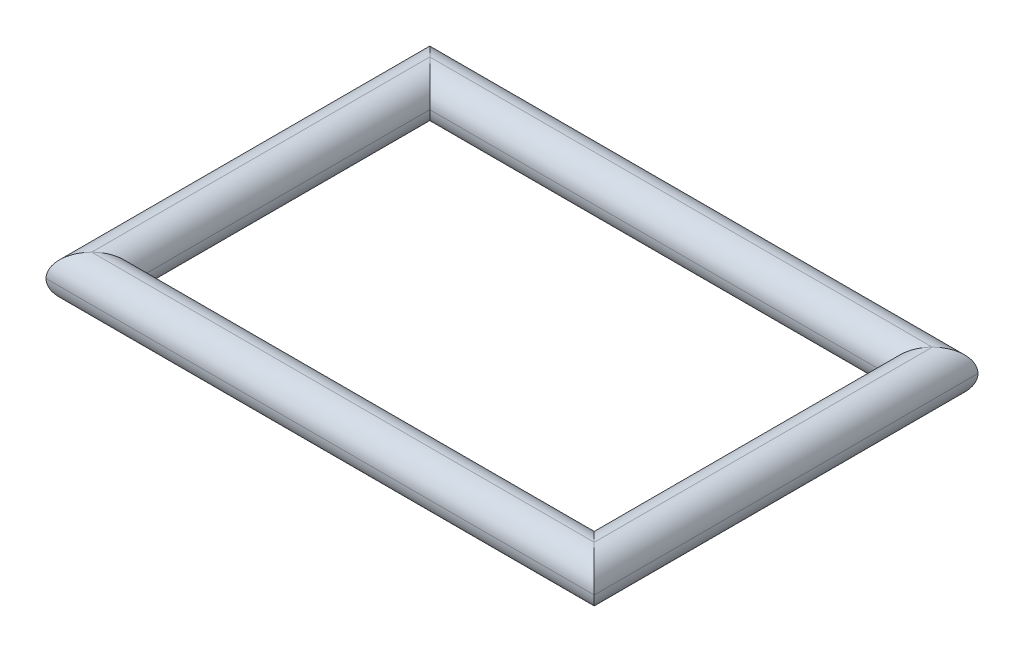
ISO-10303-21;
HEADER;
FILE_DESCRIPTION(('STEP AP214'),'2;1');
FILE_NAME('part.step','',(''),(''),'','','');
FILE_SCHEMA(('AUTOMOTIVE_DESIGN { 1 0 10303 214 1 1 1 1 }'));
ENDSEC;
DATA;
#1=APPLICATION_CONTEXT('core data for automotive mechanical design processes');
#2=APPLICATION_PROTOCOL_DEFINITION('international standard','automotive_design',2000,#1);
#3=PRODUCT_CONTEXT('',#1,'mechanical');
#4=PRODUCT('Part','Part','',(#3));
#5=PRODUCT_RELATED_PRODUCT_CATEGORY('part','',(#4));
#6=PRODUCT_DEFINITION_FORMATION('','',#4);
#7=PRODUCT_DEFINITION_CONTEXT('part definition',#1,'design');
#8=PRODUCT_DEFINITION('design','',#6,#7);
#9=PRODUCT_DEFINITION_SHAPE('','',#8);
#10=(LENGTH_UNIT() NAMED_UNIT(*) SI_UNIT(.MILLI.,.METRE.));
#11=(NAMED_UNIT(*) PLANE_ANGLE_UNIT() SI_UNIT($,.RADIAN.));
#12=(NAMED_UNIT(*) SI_UNIT($,.STERADIAN.) SOLID_ANGLE_UNIT());
#13=UNCERTAINTY_MEASURE_WITH_UNIT(LENGTH_MEASURE(1.E-05),#10,'distance_accuracy_value','');
#14=(GEOMETRIC_REPRESENTATION_CONTEXT(3) GLOBAL_UNCERTAINTY_ASSIGNED_CONTEXT((#13)) GLOBAL_UNIT_ASSIGNED_CONTEXT((#10,
#11,#12)) REPRESENTATION_CONTEXT('',''));
#15=CARTESIAN_POINT('',(0.,0.,0.));
#16=DIRECTION('',(0.,0.,1.));
#17=DIRECTION('',(1.,0.,0.));
#18=AXIS2_PLACEMENT_3D('',#15,#16,#17);
#19=CARTESIAN_POINT('',(-30.5188679245283,2.5,-20.4716981132076));
#20=DIRECTION('',(0.,0.,1.));
#21=DIRECTION('',(1.,0.,0.));
#22=AXIS2_PLACEMENT_3D('',#19,#20,#21);
#23=CYLINDRICAL_SURFACE('',#22,2.5);
#24=CARTESIAN_POINT('',(-30.5188679245283,2.5,14.0283018867924));
#25=DIRECTION('',(0.707106781186547,0.,0.707106781186547));
#26=DIRECTION('',(-0.707106781186547,0.,0.707106781186548));
#27=AXIS2_PLACEMENT_3D('',#24,#25,#26);
#28=ELLIPSE('',#27,3.53553390593274,2.5);
#29=CARTESIAN_POINT('',(-28.0188679245283,2.5,11.5283018867924));
#30=VERTEX_POINT('',#29);
#31=CARTESIAN_POINT('',(-30.5188679245283,5.,14.0283018867924));
#32=VERTEX_POINT('',#31);
#33=EDGE_CURVE('E54',#30,#32,#28,.T.);
#34=ORIENTED_EDGE('',*,*,#33,.F.);
#35=DIRECTION('',(0.,0.,1.));
#36=VECTOR('',#35,1.);
#37=CARTESIAN_POINT('',(-28.0188679245283,2.5,-20.4716981132076));
#38=LINE('',#37,#36);
#39=CARTESIAN_POINT('',(-28.0188679245283,2.5,-20.4716981132076));
#40=VERTEX_POINT('',#39);
#41=EDGE_CURVE('E45',#40,#30,#38,.T.);
#42=ORIENTED_EDGE('',*,*,#41,.F.);
#43=CARTESIAN_POINT('',(-30.5188679245283,2.5,-22.9716981132076));
#44=DIRECTION('',(-0.707106781186547,0.,0.707106781186548));
#45=DIRECTION('',(-0.707106781186547,0.,-0.707106781186547));
#46=AXIS2_PLACEMENT_3D('',#43,#44,#45);
#47=ELLIPSE('',#46,3.53553390593274,2.5);
#48=CARTESIAN_POINT('',(-30.5188679245283,5.,-22.9716981132076));
#49=VERTEX_POINT('',#48);
#50=EDGE_CURVE('E167',#49,#40,#47,.F.);
#51=ORIENTED_EDGE('',*,*,#50,.F.);
#52=DIRECTION('',(0.,0.,1.));
#53=VECTOR('',#52,1.);
#54=CARTESIAN_POINT('',(-30.5188679245283,5.,0.));
#55=LINE('',#54,#53);
#56=EDGE_CURVE('E173',#32,#49,#55,.F.);
#57=ORIENTED_EDGE('',*,*,#56,.F.);
#58=EDGE_LOOP('',(#34,#42,#51,#57));
#59=FACE_BOUND('',#58,.T.);
#60=ADVANCED_FACE('F35',(#59),#23,.T.);
#61=CARTESIAN_POINT('',(-28.0188679245283,2.5,-22.9716981132076));
#62=DIRECTION('',(-1.,0.,0.));
#63=DIRECTION('',(0.,0.,1.));
#64=AXIS2_PLACEMENT_3D('',#61,#62,#63);
#65=CYLINDRICAL_SURFACE('',#64,2.5);
#66=ORIENTED_EDGE('',*,*,#50,.T.);
#67=DIRECTION('',(-1.,0.,0.));
#68=VECTOR('',#67,1.);
#69=CARTESIAN_POINT('',(-28.0188679245283,2.5,-20.4716981132076));
#70=LINE('',#69,#68);
#71=CARTESIAN_POINT('',(21.9811320754717,2.5,-20.4716981132076));
#72=VERTEX_POINT('',#71);
#73=EDGE_CURVE('E180',#72,#40,#70,.T.);
#74=ORIENTED_EDGE('',*,*,#73,.F.);
#75=CARTESIAN_POINT('',(24.4811320754717,2.5,-22.9716981132076));
#76=DIRECTION('',(-0.707106781186548,0.,-0.707106781186547));
#77=DIRECTION('',(0.707106781186547,0.,-0.707106781186548));
#78=AXIS2_PLACEMENT_3D('',#75,#76,#77);
#79=ELLIPSE('',#78,3.53553390593274,2.5);
#80=CARTESIAN_POINT('',(24.4811320754717,5.,-22.9716981132076));
#81=VERTEX_POINT('',#80);
#82=EDGE_CURVE('E195',#81,#72,#79,.F.);
#83=ORIENTED_EDGE('',*,*,#82,.F.);
#84=DIRECTION('',(-1.,0.,0.));
#85=VECTOR('',#84,1.);
#86=CARTESIAN_POINT('',(0.,5.,-22.9716981132076));
#87=LINE('',#86,#85);
#88=EDGE_CURVE('E156',#49,#81,#87,.F.);
#89=ORIENTED_EDGE('',*,*,#88,.F.);
#90=EDGE_LOOP('',(#66,#74,#83,#89));
#91=FACE_BOUND('',#90,.T.);
#92=ADVANCED_FACE('F217',(#91),#65,.T.);
#93=CARTESIAN_POINT('',(-30.5188679245283,2.5,0.));
#94=DIRECTION('',(0.,0.,1.));
#95=DIRECTION('',(1.,0.,0.));
#96=AXIS2_PLACEMENT_3D('',#93,#94,#95);
#97=CYLINDRICAL_SURFACE('',#96,2.5);
#98=CARTESIAN_POINT('',(-30.5188679245283,2.5,14.0283018867924));
#99=DIRECTION('',(0.707106781186548,0.,0.707106781186547));
#100=DIRECTION('',(-0.707106781186547,0.,0.707106781186548));
#101=AXIS2_PLACEMENT_3D('',#98,#99,#100);
#102=ELLIPSE('',#101,3.53553390593274,2.5);
#103=CARTESIAN_POINT('',(-33.0188679245283,2.5,16.5283018867924));
#104=VERTEX_POINT('',#103);
#105=EDGE_CURVE('E189',#32,#104,#102,.T.);
#106=ORIENTED_EDGE('',*,*,#105,.F.);
#107=ORIENTED_EDGE('',*,*,#56,.T.);
#108=CARTESIAN_POINT('',(-30.5188679245283,2.5,-22.9716981132076));
#109=DIRECTION('',(-0.707106781186547,0.,0.707106781186548));
#110=DIRECTION('',(-0.707106781186548,0.,-0.707106781186547));
#111=AXIS2_PLACEMENT_3D('',#108,#109,#110);
#112=ELLIPSE('',#111,3.53553390593274,2.5);
#113=CARTESIAN_POINT('',(-33.0188679245283,2.5,-25.4716981132076));
#114=VERTEX_POINT('',#113);
#115=EDGE_CURVE('E192',#114,#49,#112,.F.);
#116=ORIENTED_EDGE('',*,*,#115,.F.);
#117=DIRECTION('',(0.,0.,1.));
#118=VECTOR('',#117,1.);
#119=CARTESIAN_POINT('',(-33.0188679245283,2.5,-25.4716981132076));
#120=LINE('',#119,#118);
#121=EDGE_CURVE('E170',#104,#114,#120,.F.);
#122=ORIENTED_EDGE('',*,*,#121,.F.);
#123=EDGE_LOOP('',(#106,#107,#116,#122));
#124=FACE_BOUND('',#123,.T.);
#125=ADVANCED_FACE('F220',(#124),#97,.T.);
#126=CARTESIAN_POINT('',(-28.0188679245283,2.5,14.0283018867924));
#127=DIRECTION('',(1.,0.,0.));
#128=DIRECTION('',(0.,0.,-1.));
#129=AXIS2_PLACEMENT_3D('',#126,#127,#128);
#130=CYLINDRICAL_SURFACE('',#129,2.5);
#131=CARTESIAN_POINT('',(24.4811320754717,2.5,14.0283018867924));
#132=DIRECTION('',(0.707106781186547,0.,-0.707106781186548));
#133=DIRECTION('',(-0.707106781186548,0.,-0.707106781186547));
#134=AXIS2_PLACEMENT_3D('',#131,#132,#133);
#135=ELLIPSE('',#134,3.53553390593274,2.5);
#136=CARTESIAN_POINT('',(21.9811320754717,2.5,11.5283018867924));
#137=VERTEX_POINT('',#136);
#138=CARTESIAN_POINT('',(24.4811320754717,5.,14.0283018867924));
#139=VERTEX_POINT('',#138);
#140=EDGE_CURVE('E135',#137,#139,#135,.T.);
#141=ORIENTED_EDGE('',*,*,#140,.F.);
#142=DIRECTION('',(1.,0.,0.));
#143=VECTOR('',#142,1.);
#144=CARTESIAN_POINT('',(-28.0188679245283,2.5,11.5283018867924));
#145=LINE('',#144,#143);
#146=EDGE_CURVE('E12',#30,#137,#145,.T.);
#147=ORIENTED_EDGE('',*,*,#146,.F.);
#148=ORIENTED_EDGE('',*,*,#33,.T.);
#149=DIRECTION('',(1.,0.,0.));
#150=VECTOR('',#149,1.);
#151=CARTESIAN_POINT('',(0.,5.,14.0283018867924));
#152=LINE('',#151,#150);
#153=EDGE_CURVE('E186',#139,#32,#152,.F.);
#154=ORIENTED_EDGE('',*,*,#153,.F.);
#155=EDGE_LOOP('',(#141,#147,#148,#154));
#156=FACE_BOUND('',#155,.T.);
#157=ADVANCED_FACE('F221',(#156),#130,.T.);
#158=CARTESIAN_POINT('',(24.4811320754717,2.5,-20.4716981132076));
#159=DIRECTION('',(0.,0.,-1.));
#160=DIRECTION('',(-1.,0.,0.));
#161=AXIS2_PLACEMENT_3D('',#158,#159,#160);
#162=CYLINDRICAL_SURFACE('',#161,2.5);
#163=DIRECTION('',(0.,0.,-1.));
#164=VECTOR('',#163,1.);
#165=CARTESIAN_POINT('',(21.9811320754717,2.5,-20.4716981132076));
#166=LINE('',#165,#164);
#167=EDGE_CURVE('E89',#137,#72,#166,.T.);
#168=ORIENTED_EDGE('',*,*,#167,.F.);
#169=ORIENTED_EDGE('',*,*,#140,.T.);
#170=DIRECTION('',(0.,0.,-1.));
#171=VECTOR('',#170,1.);
#172=CARTESIAN_POINT('',(24.4811320754717,5.,0.));
#173=LINE('',#172,#171);
#174=EDGE_CURVE('E160',#81,#139,#173,.F.);
#175=ORIENTED_EDGE('',*,*,#174,.F.);
#176=ORIENTED_EDGE('',*,*,#82,.T.);
#177=EDGE_LOOP('',(#168,#169,#175,#176));
#178=FACE_BOUND('',#177,.T.);
#179=ADVANCED_FACE('F232',(#178),#162,.T.);
#180=CARTESIAN_POINT('',(-33.0188679245283,2.5,-22.9716981132076));
#181=DIRECTION('',(-1.,0.,0.));
#182=DIRECTION('',(0.,0.,1.));
#183=AXIS2_PLACEMENT_3D('',#180,#181,#182);
#184=CYLINDRICAL_SURFACE('',#183,2.5);
#185=ORIENTED_EDGE('',*,*,#115,.T.);
#186=ORIENTED_EDGE('',*,*,#88,.T.);
#187=CARTESIAN_POINT('',(24.4811320754717,2.5,-22.9716981132076));
#188=DIRECTION('',(-0.707106781186548,0.,-0.707106781186547));
#189=DIRECTION('',(-0.707106781186547,0.,0.707106781186548));
#190=AXIS2_PLACEMENT_3D('',#187,#188,#189);
#191=ELLIPSE('',#190,3.53553390593274,2.5);
#192=CARTESIAN_POINT('',(26.9811320754717,2.5,-25.4716981132076));
#193=VERTEX_POINT('',#192);
#194=EDGE_CURVE('E151',#193,#81,#191,.F.);
#195=ORIENTED_EDGE('',*,*,#194,.F.);
#196=DIRECTION('',(1.,0.,0.));
#197=VECTOR('',#196,1.);
#198=CARTESIAN_POINT('',(26.9811320754717,2.5,-25.4716981132076));
#199=LINE('',#198,#197);
#200=EDGE_CURVE('E118',#114,#193,#199,.T.);
#201=ORIENTED_EDGE('',*,*,#200,.F.);
#202=EDGE_LOOP('',(#185,#186,#195,#201));
#203=FACE_BOUND('',#202,.T.);
#204=ADVANCED_FACE('F154',(#203),#184,.T.);
#205=CARTESIAN_POINT('',(0.,2.5,14.0283018867924));
#206=DIRECTION('',(1.,0.,0.));
#207=DIRECTION('',(0.,0.,-1.));
#208=AXIS2_PLACEMENT_3D('',#205,#206,#207);
#209=CYLINDRICAL_SURFACE('',#208,2.5);
#210=ORIENTED_EDGE('',*,*,#105,.T.);
#211=DIRECTION('',(1.,0.,0.));
#212=VECTOR('',#211,1.);
#213=CARTESIAN_POINT('',(-33.0188679245283,2.5,16.5283018867924));
#214=LINE('',#213,#212);
#215=CARTESIAN_POINT('',(26.9811320754717,2.5,16.5283018867924));
#216=VERTEX_POINT('',#215);
#217=EDGE_CURVE('E166',#216,#104,#214,.F.);
#218=ORIENTED_EDGE('',*,*,#217,.F.);
#219=CARTESIAN_POINT('',(24.4811320754717,2.5,14.0283018867924));
#220=DIRECTION('',(0.707106781186547,0.,-0.707106781186548));
#221=DIRECTION('',(0.707106781186548,0.,0.707106781186547));
#222=AXIS2_PLACEMENT_3D('',#219,#220,#221);
#223=ELLIPSE('',#222,3.53553390593274,2.5);
#224=EDGE_CURVE('E94',#139,#216,#223,.T.);
#225=ORIENTED_EDGE('',*,*,#224,.F.);
#226=ORIENTED_EDGE('',*,*,#153,.T.);
#227=EDGE_LOOP('',(#210,#218,#225,#226));
#228=FACE_BOUND('',#227,.T.);
#229=ADVANCED_FACE('F224',(#228),#209,.T.);
#230=CARTESIAN_POINT('',(24.4811320754717,2.5,-25.4716981132076));
#231=DIRECTION('',(0.,0.,-1.));
#232=DIRECTION('',(-1.,0.,0.));
#233=AXIS2_PLACEMENT_3D('',#230,#231,#232);
#234=CYLINDRICAL_SURFACE('',#233,2.5);
#235=ORIENTED_EDGE('',*,*,#194,.T.);
#236=ORIENTED_EDGE('',*,*,#174,.T.);
#237=ORIENTED_EDGE('',*,*,#224,.T.);
#238=DIRECTION('',(0.,0.,1.));
#239=VECTOR('',#238,1.);
#240=CARTESIAN_POINT('',(26.9811320754717,2.5,16.5283018867924));
#241=LINE('',#240,#239);
#242=EDGE_CURVE('E162',#193,#216,#241,.T.);
#243=ORIENTED_EDGE('',*,*,#242,.F.);
#244=EDGE_LOOP('',(#235,#236,#237,#243));
#245=FACE_BOUND('',#244,.T.);
#246=ADVANCED_FACE('F163',(#245),#234,.T.);
#247=CARTESIAN_POINT('',(24.4811320754717,2.5,0.));
#248=DIRECTION('',(0.,0.,1.));
#249=DIRECTION('',(1.,0.,0.));
#250=AXIS2_PLACEMENT_3D('',#247,#248,#249);
#251=CYLINDRICAL_SURFACE('',#250,2.5);
#252=CARTESIAN_POINT('',(24.4811320754717,2.5,14.0283018867924));
#253=DIRECTION('',(-0.707106781186547,0.,0.707106781186548));
#254=DIRECTION('',(0.707106781186548,0.,0.707106781186547));
#255=AXIS2_PLACEMENT_3D('',#252,#253,#254);
#256=ELLIPSE('',#255,3.53553390593274,2.5);
#257=CARTESIAN_POINT('',(24.4811320754717,0.,14.0283018867924));
#258=VERTEX_POINT('',#257);
#259=EDGE_CURVE('E106',#137,#258,#256,.T.);
#260=ORIENTED_EDGE('',*,*,#259,.F.);
#261=ORIENTED_EDGE('',*,*,#167,.T.);
#262=CARTESIAN_POINT('',(24.4811320754717,2.5,-22.9716981132076));
#263=DIRECTION('',(0.707106781186548,0.,0.707106781186547));
#264=DIRECTION('',(0.707106781186547,0.,-0.707106781186548));
#265=AXIS2_PLACEMENT_3D('',#262,#263,#264);
#266=ELLIPSE('',#265,3.53553390593274,2.5);
#267=CARTESIAN_POINT('',(24.4811320754717,0.,-22.9716981132076));
#268=VERTEX_POINT('',#267);
#269=EDGE_CURVE('E39',#268,#72,#266,.F.);
#270=ORIENTED_EDGE('',*,*,#269,.F.);
#271=DIRECTION('',(0.,0.,-1.));
#272=VECTOR('',#271,1.);
#273=CARTESIAN_POINT('',(24.4811320754717,0.,-20.4716981132076));
#274=LINE('',#273,#272);
#275=EDGE_CURVE('E83',#258,#268,#274,.T.);
#276=ORIENTED_EDGE('',*,*,#275,.F.);
#277=EDGE_LOOP('',(#260,#261,#270,#276));
#278=FACE_BOUND('',#277,.T.);
#279=ADVANCED_FACE('F37',(#278),#251,.T.);
#280=CARTESIAN_POINT('',(0.,2.5,-22.9716981132076));
#281=DIRECTION('',(1.,0.,0.));
#282=DIRECTION('',(0.,0.,-1.));
#283=AXIS2_PLACEMENT_3D('',#280,#281,#282);
#284=CYLINDRICAL_SURFACE('',#283,2.5);
#285=ORIENTED_EDGE('',*,*,#269,.T.);
#286=ORIENTED_EDGE('',*,*,#73,.T.);
#287=CARTESIAN_POINT('',(-30.5188679245283,2.5,-22.9716981132076));
#288=DIRECTION('',(0.707106781186547,0.,-0.707106781186548));
#289=DIRECTION('',(0.707106781186547,0.,0.707106781186547));
#290=AXIS2_PLACEMENT_3D('',#287,#288,#289);
#291=ELLIPSE('',#290,3.53553390593274,2.5);
#292=CARTESIAN_POINT('',(-30.5188679245283,0.,-22.9716981132076));
#293=VERTEX_POINT('',#292);
#294=EDGE_CURVE('E111',#293,#40,#291,.F.);
#295=ORIENTED_EDGE('',*,*,#294,.F.);
#296=DIRECTION('',(-1.,0.,0.));
#297=VECTOR('',#296,1.);
#298=CARTESIAN_POINT('',(-28.0188679245283,0.,-22.9716981132076));
#299=LINE('',#298,#297);
#300=EDGE_CURVE('E108',#268,#293,#299,.T.);
#301=ORIENTED_EDGE('',*,*,#300,.F.);
#302=EDGE_LOOP('',(#285,#286,#295,#301));
#303=FACE_BOUND('',#302,.T.);
#304=ADVANCED_FACE('F109',(#303),#284,.T.);
#305=CARTESIAN_POINT('',(24.4811320754717,2.5,0.));
#306=DIRECTION('',(0.,0.,1.));
#307=DIRECTION('',(1.,0.,0.));
#308=AXIS2_PLACEMENT_3D('',#305,#306,#307);
#309=CYLINDRICAL_SURFACE('',#308,2.5);
#310=CARTESIAN_POINT('',(24.4811320754717,2.5,14.0283018867924));
#311=DIRECTION('',(-0.707106781186547,0.,0.707106781186548));
#312=DIRECTION('',(0.707106781186548,0.,0.707106781186547));
#313=AXIS2_PLACEMENT_3D('',#310,#311,#312);
#314=ELLIPSE('',#313,3.53553390593274,2.5);
#315=EDGE_CURVE('E104',#258,#216,#314,.T.);
#316=ORIENTED_EDGE('',*,*,#315,.F.);
#317=ORIENTED_EDGE('',*,*,#275,.T.);
#318=CARTESIAN_POINT('',(24.4811320754717,2.5,-22.9716981132076));
#319=DIRECTION('',(0.707106781186548,0.,0.707106781186547));
#320=DIRECTION('',(0.707106781186547,0.,-0.707106781186548));
#321=AXIS2_PLACEMENT_3D('',#318,#319,#320);
#322=ELLIPSE('',#321,3.53553390593274,2.5);
#323=EDGE_CURVE('E101',#193,#268,#322,.F.);
#324=ORIENTED_EDGE('',*,*,#323,.F.);
#325=ORIENTED_EDGE('',*,*,#242,.T.);
#326=EDGE_LOOP('',(#316,#317,#324,#325));
#327=FACE_BOUND('',#326,.T.);
#328=ADVANCED_FACE('F98',(#327),#309,.T.);
#329=CARTESIAN_POINT('',(0.,2.5,14.0283018867924));
#330=DIRECTION('',(-1.,0.,0.));
#331=DIRECTION('',(0.,0.,1.));
#332=AXIS2_PLACEMENT_3D('',#329,#330,#331);
#333=CYLINDRICAL_SURFACE('',#332,2.5);
#334=CARTESIAN_POINT('',(-30.5188679245283,2.5,14.0283018867924));
#335=DIRECTION('',(-0.707106781186547,0.,-0.707106781186547));
#336=DIRECTION('',(-0.707106781186547,0.,0.707106781186548));
#337=AXIS2_PLACEMENT_3D('',#334,#335,#336);
#338=ELLIPSE('',#337,3.53553390593274,2.5);
#339=CARTESIAN_POINT('',(-30.5188679245283,0.,14.0283018867924));
#340=VERTEX_POINT('',#339);
#341=EDGE_CURVE('E125',#30,#340,#338,.T.);
#342=ORIENTED_EDGE('',*,*,#341,.F.);
#343=ORIENTED_EDGE('',*,*,#146,.T.);
#344=ORIENTED_EDGE('',*,*,#259,.T.);
#345=DIRECTION('',(1.,0.,0.));
#346=VECTOR('',#345,1.);
#347=CARTESIAN_POINT('',(21.9811320754717,0.,14.0283018867924));
#348=LINE('',#347,#346);
#349=EDGE_CURVE('E120',#340,#258,#348,.T.);
#350=ORIENTED_EDGE('',*,*,#349,.F.);
#351=EDGE_LOOP('',(#342,#343,#344,#350));
#352=FACE_BOUND('',#351,.T.);
#353=ADVANCED_FACE('F130',(#352),#333,.T.);
#354=CARTESIAN_POINT('',(-30.5188679245283,2.5,0.));
#355=DIRECTION('',(0.,0.,-1.));
#356=DIRECTION('',(-1.,0.,0.));
#357=AXIS2_PLACEMENT_3D('',#354,#355,#356);
#358=CYLINDRICAL_SURFACE('',#357,2.5);
#359=ORIENTED_EDGE('',*,*,#41,.T.);
#360=ORIENTED_EDGE('',*,*,#341,.T.);
#361=DIRECTION('',(0.,0.,1.));
#362=VECTOR('',#361,1.);
#363=CARTESIAN_POINT('',(-30.5188679245283,0.,11.5283018867924));
#364=LINE('',#363,#362);
#365=EDGE_CURVE('E206',#293,#340,#364,.T.);
#366=ORIENTED_EDGE('',*,*,#365,.F.);
#367=ORIENTED_EDGE('',*,*,#294,.T.);
#368=EDGE_LOOP('',(#359,#360,#366,#367));
#369=FACE_BOUND('',#368,.T.);
#370=ADVANCED_FACE('F214',(#369),#358,.T.);
#371=CARTESIAN_POINT('',(0.,2.5,-22.9716981132076));
#372=DIRECTION('',(1.,0.,0.));
#373=DIRECTION('',(0.,0.,-1.));
#374=AXIS2_PLACEMENT_3D('',#371,#372,#373);
#375=CYLINDRICAL_SURFACE('',#374,2.5);
#376=ORIENTED_EDGE('',*,*,#323,.T.);
#377=ORIENTED_EDGE('',*,*,#300,.T.);
#378=CARTESIAN_POINT('',(-30.5188679245283,2.5,-22.9716981132076));
#379=DIRECTION('',(0.707106781186547,0.,-0.707106781186548));
#380=DIRECTION('',(0.707106781186548,0.,0.707106781186547));
#381=AXIS2_PLACEMENT_3D('',#378,#379,#380);
#382=ELLIPSE('',#381,3.53553390593274,2.5);
#383=EDGE_CURVE('E203',#114,#293,#382,.F.);
#384=ORIENTED_EDGE('',*,*,#383,.F.);
#385=ORIENTED_EDGE('',*,*,#200,.T.);
#386=EDGE_LOOP('',(#376,#377,#384,#385));
#387=FACE_BOUND('',#386,.T.);
#388=ADVANCED_FACE('F116',(#387),#375,.T.);
#389=CARTESIAN_POINT('',(-33.0188679245283,2.5,14.0283018867924));
#390=DIRECTION('',(-1.,0.,0.));
#391=DIRECTION('',(0.,0.,1.));
#392=AXIS2_PLACEMENT_3D('',#389,#390,#391);
#393=CYLINDRICAL_SURFACE('',#392,2.5);
#394=ORIENTED_EDGE('',*,*,#315,.T.);
#395=ORIENTED_EDGE('',*,*,#217,.T.);
#396=CARTESIAN_POINT('',(-30.5188679245283,2.5,14.0283018867924));
#397=DIRECTION('',(-0.707106781186548,0.,-0.707106781186547));
#398=DIRECTION('',(-0.707106781186547,0.,0.707106781186548));
#399=AXIS2_PLACEMENT_3D('',#396,#397,#398);
#400=ELLIPSE('',#399,3.53553390593274,2.5);
#401=EDGE_CURVE('E201',#340,#104,#400,.T.);
#402=ORIENTED_EDGE('',*,*,#401,.F.);
#403=ORIENTED_EDGE('',*,*,#349,.T.);
#404=EDGE_LOOP('',(#394,#395,#402,#403));
#405=FACE_BOUND('',#404,.T.);
#406=ADVANCED_FACE('F209',(#405),#393,.T.);
#407=CARTESIAN_POINT('',(-30.5188679245283,2.5,-25.4716981132076));
#408=DIRECTION('',(0.,0.,-1.));
#409=DIRECTION('',(-1.,0.,0.));
#410=AXIS2_PLACEMENT_3D('',#407,#408,#409);
#411=CYLINDRICAL_SURFACE('',#410,2.5);
#412=ORIENTED_EDGE('',*,*,#383,.T.);
#413=ORIENTED_EDGE('',*,*,#365,.T.);
#414=ORIENTED_EDGE('',*,*,#401,.T.);
#415=ORIENTED_EDGE('',*,*,#121,.T.);
#416=EDGE_LOOP('',(#412,#413,#414,#415));
#417=FACE_BOUND('',#416,.T.);
#418=ADVANCED_FACE('F212',(#417),#411,.T.);
#419=CLOSED_SHELL('',(#60,#92,#125,#157,#179,#204,#229,#246,#279,#304,#328,#353,#370,#388,#406,#418));
#420=MANIFOLD_SOLID_BREP('B2',#419);
#421=ADVANCED_BREP_SHAPE_REPRESENTATION('',(#18,#420),#14);
#422=SHAPE_DEFINITION_REPRESENTATION(#9,#421);
ENDSEC;
END-ISO-10303-21;
